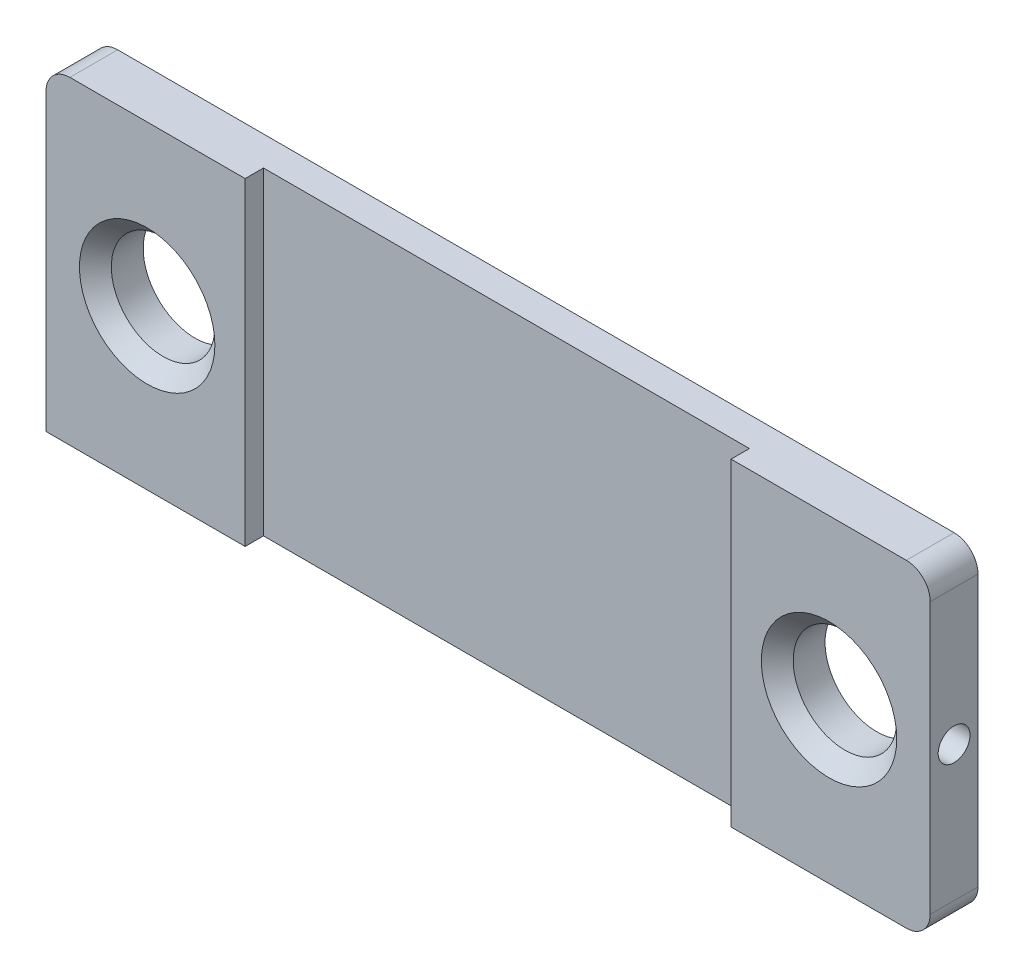
ISO-10303-21;
HEADER;
FILE_DESCRIPTION(('STEP AP214'),'2;1');
FILE_NAME('part.step','',(''),(''),'','','');
FILE_SCHEMA(('AUTOMOTIVE_DESIGN { 1 0 10303 214 1 1 1 1 }'));
ENDSEC;
DATA;
#1=APPLICATION_CONTEXT('core data for automotive mechanical design processes');
#2=APPLICATION_PROTOCOL_DEFINITION('international standard','automotive_design',2000,#1);
#3=PRODUCT_CONTEXT('',#1,'mechanical');
#4=PRODUCT('Part','Part','',(#3));
#5=PRODUCT_RELATED_PRODUCT_CATEGORY('part','',(#4));
#6=PRODUCT_DEFINITION_FORMATION('','',#4);
#7=PRODUCT_DEFINITION_CONTEXT('part definition',#1,'design');
#8=PRODUCT_DEFINITION('design','',#6,#7);
#9=PRODUCT_DEFINITION_SHAPE('','',#8);
#10=(LENGTH_UNIT() NAMED_UNIT(*) SI_UNIT(.MILLI.,.METRE.));
#11=(NAMED_UNIT(*) PLANE_ANGLE_UNIT() SI_UNIT($,.RADIAN.));
#12=(NAMED_UNIT(*) SI_UNIT($,.STERADIAN.) SOLID_ANGLE_UNIT());
#13=UNCERTAINTY_MEASURE_WITH_UNIT(LENGTH_MEASURE(1.E-05),#10,'distance_accuracy_value','');
#14=(GEOMETRIC_REPRESENTATION_CONTEXT(3) GLOBAL_UNCERTAINTY_ASSIGNED_CONTEXT((#13)) GLOBAL_UNIT_ASSIGNED_CONTEXT((#10,
#11,#12)) REPRESENTATION_CONTEXT('',''));
#15=CARTESIAN_POINT('',(0.,0.,0.));
#16=DIRECTION('',(0.,0.,1.));
#17=DIRECTION('',(1.,0.,0.));
#18=AXIS2_PLACEMENT_3D('',#15,#16,#17);
#19=CARTESIAN_POINT('',(0.,-91.9139935115387,3.));
#20=DIRECTION('',(0.,0.,1.));
#21=DIRECTION('',(1.,0.,0.));
#22=AXIS2_PLACEMENT_3D('',#19,#20,#21);
#23=PLANE('',#22);
#24=DIRECTION('',(0.,-1.,0.));
#25=VECTOR('',#24,1.);
#26=CARTESIAN_POINT('',(-30.5,20.,3.));
#27=LINE('',#26,#25);
#28=CARTESIAN_POINT('',(-30.5,20.,3.));
#29=VERTEX_POINT('',#28);
#30=CARTESIAN_POINT('',(-30.5,-20.,3.));
#31=VERTEX_POINT('',#30);
#32=EDGE_CURVE('E145',#29,#31,#27,.T.);
#33=ORIENTED_EDGE('',*,*,#32,.F.);
#34=DIRECTION('',(1.,0.,0.));
#35=VECTOR('',#34,1.);
#36=CARTESIAN_POINT('',(0.,20.,3.));
#37=LINE('',#36,#35);
#38=CARTESIAN_POINT('',(-52.5,20.,3.));
#39=VERTEX_POINT('',#38);
#40=EDGE_CURVE('E191',#39,#29,#37,.T.);
#41=ORIENTED_EDGE('',*,*,#40,.F.);
#42=CARTESIAN_POINT('',(-52.5,17.,3.));
#43=DIRECTION('',(0.,0.,1.));
#44=DIRECTION('',(1.,0.,0.));
#45=AXIS2_PLACEMENT_3D('',#42,#43,#44);
#46=CIRCLE('',#45,3.);
#47=CARTESIAN_POINT('',(-55.5,17.,3.));
#48=VERTEX_POINT('',#47);
#49=EDGE_CURVE('E51',#39,#48,#46,.T.);
#50=ORIENTED_EDGE('',*,*,#49,.T.);
#51=DIRECTION('',(0.,-1.,0.));
#52=VECTOR('',#51,1.);
#53=CARTESIAN_POINT('',(-55.5,-91.9139935115387,3.));
#54=LINE('',#53,#52);
#55=CARTESIAN_POINT('',(-55.5,-20.,3.));
#56=VERTEX_POINT('',#55);
#57=EDGE_CURVE('E194',#48,#56,#54,.T.);
#58=ORIENTED_EDGE('',*,*,#57,.T.);
#59=DIRECTION('',(1.,0.,0.));
#60=VECTOR('',#59,1.);
#61=CARTESIAN_POINT('',(0.,-20.,3.));
#62=LINE('',#61,#60);
#63=EDGE_CURVE('E197',#56,#31,#62,.T.);
#64=ORIENTED_EDGE('',*,*,#63,.T.);
#65=EDGE_LOOP('',(#33,#41,#50,#58,#64));
#66=FACE_BOUND('',#65,.T.);
#67=CARTESIAN_POINT('',(-42.8,0.,3.));
#68=DIRECTION('',(0.,0.,1.));
#69=DIRECTION('',(1.,0.,0.));
#70=AXIS2_PLACEMENT_3D('',#67,#68,#69);
#71=CIRCLE('',#70,8.50000000000001);
#72=CARTESIAN_POINT('',(-34.3,0.,3.));
#73=VERTEX_POINT('',#72);
#74=EDGE_CURVE('E234',#73,#73,#71,.F.);
#75=ORIENTED_EDGE('',*,*,#74,.T.);
#76=EDGE_LOOP('',(#75));
#77=FACE_BOUND('',#76,.T.);
#78=ADVANCED_FACE('F28',(#66,#77),#23,.T.);
#79=CARTESIAN_POINT('',(55.5,-91.9139935115387,3.));
#80=DIRECTION('',(1.,0.,0.));
#81=DIRECTION('',(0.,1.,0.));
#82=AXIS2_PLACEMENT_3D('',#79,#80,#81);
#83=PLANE('',#82);
#84=CARTESIAN_POINT('',(55.5,0.,0.));
#85=DIRECTION('',(1.,0.,0.));
#86=DIRECTION('',(0.,0.,-1.));
#87=AXIS2_PLACEMENT_3D('',#84,#85,#86);
#88=CIRCLE('',#87,2.);
#89=CARTESIAN_POINT('',(55.5,0.,-2.));
#90=VERTEX_POINT('',#89);
#91=EDGE_CURVE('E136',#90,#90,#88,.T.);
#92=ORIENTED_EDGE('',*,*,#91,.F.);
#93=EDGE_LOOP('',(#92));
#94=FACE_BOUND('',#93,.T.);
#95=DIRECTION('',(0.,-1.,0.));
#96=VECTOR('',#95,1.);
#97=CARTESIAN_POINT('',(55.5,-91.9139935115387,3.));
#98=LINE('',#97,#96);
#99=CARTESIAN_POINT('',(55.5,17.,3.));
#100=VERTEX_POINT('',#99);
#101=CARTESIAN_POINT('',(55.5,-17.,3.));
#102=VERTEX_POINT('',#101);
#103=EDGE_CURVE('E187',#100,#102,#98,.T.);
#104=ORIENTED_EDGE('',*,*,#103,.T.);
#105=DIRECTION('',(0.,0.,-1.));
#106=VECTOR('',#105,1.);
#107=CARTESIAN_POINT('',(55.5,-17.,-3.));
#108=LINE('',#107,#106);
#109=CARTESIAN_POINT('',(55.5,-17.,-3.));
#110=VERTEX_POINT('',#109);
#111=EDGE_CURVE('E205',#102,#110,#108,.T.);
#112=ORIENTED_EDGE('',*,*,#111,.T.);
#113=DIRECTION('',(0.,-1.,0.));
#114=VECTOR('',#113,1.);
#115=CARTESIAN_POINT('',(55.5,-91.9139935115387,-3.));
#116=LINE('',#115,#114);
#117=CARTESIAN_POINT('',(55.5,17.,-3.));
#118=VERTEX_POINT('',#117);
#119=EDGE_CURVE('E176',#118,#110,#116,.T.);
#120=ORIENTED_EDGE('',*,*,#119,.F.);
#121=DIRECTION('',(0.,0.,-1.));
#122=VECTOR('',#121,1.);
#123=CARTESIAN_POINT('',(55.5,17.,3.));
#124=LINE('',#123,#122);
#125=EDGE_CURVE('E203',#118,#100,#124,.F.);
#126=ORIENTED_EDGE('',*,*,#125,.T.);
#127=EDGE_LOOP('',(#104,#112,#120,#126));
#128=FACE_BOUND('',#127,.T.);
#129=ADVANCED_FACE('F266',(#94,#128),#83,.T.);
#130=CARTESIAN_POINT('',(0.,20.,3.));
#131=DIRECTION('',(0.,1.,0.));
#132=DIRECTION('',(0.,0.,1.));
#133=AXIS2_PLACEMENT_3D('',#130,#131,#132);
#134=PLANE('',#133);
#135=DIRECTION('',(0.,0.,1.));
#136=VECTOR('',#135,1.);
#137=CARTESIAN_POINT('',(-30.5,20.,0.7));
#138=LINE('',#137,#136);
#139=CARTESIAN_POINT('',(-30.5,20.,0.7));
#140=VERTEX_POINT('',#139);
#141=EDGE_CURVE('E162',#140,#29,#138,.T.);
#142=ORIENTED_EDGE('',*,*,#141,.F.);
#143=DIRECTION('',(-1.,0.,0.));
#144=VECTOR('',#143,1.);
#145=CARTESIAN_POINT('',(-30.5,20.,0.7));
#146=LINE('',#145,#144);
#147=CARTESIAN_POINT('',(30.5,20.,0.7));
#148=VERTEX_POINT('',#147);
#149=EDGE_CURVE('E158',#148,#140,#146,.T.);
#150=ORIENTED_EDGE('',*,*,#149,.F.);
#151=DIRECTION('',(0.,0.,1.));
#152=VECTOR('',#151,1.);
#153=CARTESIAN_POINT('',(30.5,20.,0.7));
#154=LINE('',#153,#152);
#155=CARTESIAN_POINT('',(30.5,20.,3.));
#156=VERTEX_POINT('',#155);
#157=EDGE_CURVE('E165',#148,#156,#154,.T.);
#158=ORIENTED_EDGE('',*,*,#157,.T.);
#159=CARTESIAN_POINT('',(52.5,20.,3.));
#160=VERTEX_POINT('',#159);
#161=EDGE_CURVE('E190',#156,#160,#37,.T.);
#162=ORIENTED_EDGE('',*,*,#161,.T.);
#163=DIRECTION('',(0.,0.,-1.));
#164=VECTOR('',#163,1.);
#165=CARTESIAN_POINT('',(52.5,20.,3.));
#166=LINE('',#165,#164);
#167=CARTESIAN_POINT('',(52.5,20.,-3.));
#168=VERTEX_POINT('',#167);
#169=EDGE_CURVE('E225',#160,#168,#166,.T.);
#170=ORIENTED_EDGE('',*,*,#169,.T.);
#171=DIRECTION('',(1.,0.,0.));
#172=VECTOR('',#171,1.);
#173=CARTESIAN_POINT('',(0.,20.,-3.));
#174=LINE('',#173,#172);
#175=CARTESIAN_POINT('',(-52.5,20.,-3.));
#176=VERTEX_POINT('',#175);
#177=EDGE_CURVE('E179',#176,#168,#174,.T.);
#178=ORIENTED_EDGE('',*,*,#177,.F.);
#179=DIRECTION('',(0.,0.,-1.));
#180=VECTOR('',#179,1.);
#181=CARTESIAN_POINT('',(-52.5,20.,3.));
#182=LINE('',#181,#180);
#183=EDGE_CURVE('E223',#176,#39,#182,.F.);
#184=ORIENTED_EDGE('',*,*,#183,.T.);
#185=ORIENTED_EDGE('',*,*,#40,.T.);
#186=EDGE_LOOP('',(#142,#150,#158,#162,#170,#178,#184,#185));
#187=FACE_BOUND('',#186,.T.);
#188=ADVANCED_FACE('F292',(#187),#134,.T.);
#189=CARTESIAN_POINT('',(-55.5,-91.9139935115387,3.));
#190=DIRECTION('',(1.,0.,0.));
#191=DIRECTION('',(0.,1.,0.));
#192=AXIS2_PLACEMENT_3D('',#189,#190,#191);
#193=PLANE('',#192);
#194=CARTESIAN_POINT('',(-55.5,-17.9,0.));
#195=DIRECTION('',(-1.,0.,0.));
#196=DIRECTION('',(0.,0.,1.));
#197=AXIS2_PLACEMENT_3D('',#194,#195,#196);
#198=CIRCLE('',#197,1.25);
#199=CARTESIAN_POINT('',(-55.5,-17.9,1.25));
#200=VERTEX_POINT('',#199);
#201=EDGE_CURVE('E128',#200,#200,#198,.T.);
#202=ORIENTED_EDGE('',*,*,#201,.F.);
#203=EDGE_LOOP('',(#202));
#204=FACE_BOUND('',#203,.T.);
#205=CARTESIAN_POINT('',(-55.5,0.,0.));
#206=DIRECTION('',(-1.,0.,0.));
#207=DIRECTION('',(0.,0.,1.));
#208=AXIS2_PLACEMENT_3D('',#205,#206,#207);
#209=CIRCLE('',#208,2.);
#210=CARTESIAN_POINT('',(-55.5,0.,2.));
#211=VERTEX_POINT('',#210);
#212=EDGE_CURVE('E142',#211,#211,#209,.T.);
#213=ORIENTED_EDGE('',*,*,#212,.F.);
#214=EDGE_LOOP('',(#213));
#215=FACE_BOUND('',#214,.T.);
#216=ORIENTED_EDGE('',*,*,#57,.F.);
#217=DIRECTION('',(0.,0.,-1.));
#218=VECTOR('',#217,1.);
#219=CARTESIAN_POINT('',(-55.5,17.,-3.));
#220=LINE('',#219,#218);
#221=CARTESIAN_POINT('',(-55.5,17.,-3.));
#222=VERTEX_POINT('',#221);
#223=EDGE_CURVE('E228',#48,#222,#220,.T.);
#224=ORIENTED_EDGE('',*,*,#223,.T.);
#225=DIRECTION('',(0.,-1.,0.));
#226=VECTOR('',#225,1.);
#227=CARTESIAN_POINT('',(-55.5,-91.9139935115387,-3.));
#228=LINE('',#227,#226);
#229=CARTESIAN_POINT('',(-55.5,-20.,-3.));
#230=VERTEX_POINT('',#229);
#231=EDGE_CURVE('E182',#222,#230,#228,.T.);
#232=ORIENTED_EDGE('',*,*,#231,.T.);
#233=DIRECTION('',(0.,0.,-1.));
#234=VECTOR('',#233,1.);
#235=CARTESIAN_POINT('',(-55.5,-20.,3.));
#236=LINE('',#235,#234);
#237=EDGE_CURVE('E200',#56,#230,#236,.T.);
#238=ORIENTED_EDGE('',*,*,#237,.F.);
#239=EDGE_LOOP('',(#216,#224,#232,#238));
#240=FACE_BOUND('',#239,.T.);
#241=ADVANCED_FACE('F286',(#204,#215,#240),#193,.F.);
#242=CARTESIAN_POINT('',(-42.8,0.,3.));
#243=DIRECTION('',(0.,0.,-1.));
#244=DIRECTION('',(-1.,0.,0.));
#245=AXIS2_PLACEMENT_3D('',#242,#243,#244);
#246=CYLINDRICAL_SURFACE('',#245,6.5);
#247=CARTESIAN_POINT('',(-42.8,0.,1.));
#248=DIRECTION('',(0.,0.,1.));
#249=DIRECTION('',(1.,0.,0.));
#250=AXIS2_PLACEMENT_3D('',#247,#248,#249);
#251=CIRCLE('',#250,6.5);
#252=CARTESIAN_POINT('',(-36.3,0.,1.));
#253=VERTEX_POINT('',#252);
#254=EDGE_CURVE('E11',#253,#253,#251,.T.);
#255=ORIENTED_EDGE('',*,*,#254,.T.);
#256=EDGE_LOOP('',(#255));
#257=FACE_BOUND('',#256,.T.);
#258=CARTESIAN_POINT('',(-42.8,0.,-3.));
#259=DIRECTION('',(0.,0.,1.));
#260=DIRECTION('',(1.,0.,0.));
#261=AXIS2_PLACEMENT_3D('',#258,#259,#260);
#262=CIRCLE('',#261,6.5);
#263=CARTESIAN_POINT('',(-36.3,0.,-3.));
#264=VERTEX_POINT('',#263);
#265=EDGE_CURVE('E173',#264,#264,#262,.T.);
#266=ORIENTED_EDGE('',*,*,#265,.F.);
#267=EDGE_LOOP('',(#266));
#268=FACE_BOUND('',#267,.T.);
#269=ADVANCED_FACE('F252',(#257,#268),#246,.F.);
#270=CARTESIAN_POINT('',(42.8,0.,3.));
#271=DIRECTION('',(0.,0.,-1.));
#272=DIRECTION('',(-1.,0.,0.));
#273=AXIS2_PLACEMENT_3D('',#270,#271,#272);
#274=CYLINDRICAL_SURFACE('',#273,6.5);
#275=CARTESIAN_POINT('',(42.8,0.,1.));
#276=DIRECTION('',(0.,0.,1.));
#277=DIRECTION('',(1.,0.,0.));
#278=AXIS2_PLACEMENT_3D('',#275,#276,#277);
#279=CIRCLE('',#278,6.5);
#280=CARTESIAN_POINT('',(49.3,0.,1.));
#281=VERTEX_POINT('',#280);
#282=EDGE_CURVE('E231',#281,#281,#279,.T.);
#283=ORIENTED_EDGE('',*,*,#282,.T.);
#284=EDGE_LOOP('',(#283));
#285=FACE_BOUND('',#284,.T.);
#286=CARTESIAN_POINT('',(42.8,0.,-3.));
#287=DIRECTION('',(0.,0.,1.));
#288=DIRECTION('',(1.,0.,0.));
#289=AXIS2_PLACEMENT_3D('',#286,#287,#288);
#290=CIRCLE('',#289,6.5);
#291=CARTESIAN_POINT('',(49.3,0.,-3.));
#292=VERTEX_POINT('',#291);
#293=EDGE_CURVE('E164',#292,#292,#290,.T.);
#294=ORIENTED_EDGE('',*,*,#293,.F.);
#295=EDGE_LOOP('',(#294));
#296=FACE_BOUND('',#295,.T.);
#297=ADVANCED_FACE('F30',(#285,#296),#274,.F.);
#298=CARTESIAN_POINT('',(0.,-20.,3.));
#299=DIRECTION('',(0.,1.,0.));
#300=DIRECTION('',(-1.,0.,0.));
#301=AXIS2_PLACEMENT_3D('',#298,#299,#300);
#302=PLANE('',#301);
#303=DIRECTION('',(1.,0.,0.));
#304=VECTOR('',#303,1.);
#305=CARTESIAN_POINT('',(-30.5,-20.,0.7));
#306=LINE('',#305,#304);
#307=CARTESIAN_POINT('',(-30.5,-20.,0.7));
#308=VERTEX_POINT('',#307);
#309=CARTESIAN_POINT('',(30.5,-20.,0.7));
#310=VERTEX_POINT('',#309);
#311=EDGE_CURVE('E152',#308,#310,#306,.T.);
#312=ORIENTED_EDGE('',*,*,#311,.F.);
#313=DIRECTION('',(0.,0.,1.));
#314=VECTOR('',#313,1.);
#315=CARTESIAN_POINT('',(-30.5,-20.,0.7));
#316=LINE('',#315,#314);
#317=EDGE_CURVE('E161',#308,#31,#316,.T.);
#318=ORIENTED_EDGE('',*,*,#317,.T.);
#319=ORIENTED_EDGE('',*,*,#63,.F.);
#320=ORIENTED_EDGE('',*,*,#237,.T.);
#321=DIRECTION('',(1.,0.,0.));
#322=VECTOR('',#321,1.);
#323=CARTESIAN_POINT('',(0.,-20.,-3.));
#324=LINE('',#323,#322);
#325=CARTESIAN_POINT('',(52.5,-20.,-3.));
#326=VERTEX_POINT('',#325);
#327=EDGE_CURVE('E184',#230,#326,#324,.T.);
#328=ORIENTED_EDGE('',*,*,#327,.T.);
#329=DIRECTION('',(0.,0.,-1.));
#330=VECTOR('',#329,1.);
#331=CARTESIAN_POINT('',(52.5,-20.,3.));
#332=LINE('',#331,#330);
#333=CARTESIAN_POINT('',(52.5,-20.,3.));
#334=VERTEX_POINT('',#333);
#335=EDGE_CURVE('E214',#326,#334,#332,.F.);
#336=ORIENTED_EDGE('',*,*,#335,.T.);
#337=CARTESIAN_POINT('',(30.5,-20.,3.));
#338=VERTEX_POINT('',#337);
#339=EDGE_CURVE('E196',#338,#334,#62,.T.);
#340=ORIENTED_EDGE('',*,*,#339,.F.);
#341=DIRECTION('',(0.,0.,1.));
#342=VECTOR('',#341,1.);
#343=CARTESIAN_POINT('',(30.5,-20.,0.7));
#344=LINE('',#343,#342);
#345=EDGE_CURVE('E43',#310,#338,#344,.T.);
#346=ORIENTED_EDGE('',*,*,#345,.F.);
#347=EDGE_LOOP('',(#312,#318,#319,#320,#328,#336,#340,#346));
#348=FACE_BOUND('',#347,.T.);
#349=ADVANCED_FACE('F251',(#348),#302,.F.);
#350=DIRECTION('',(0.,1.,0.));
#351=VECTOR('',#350,1.);
#352=CARTESIAN_POINT('',(30.5,20.,3.));
#353=LINE('',#352,#351);
#354=EDGE_CURVE('E147',#338,#156,#353,.T.);
#355=ORIENTED_EDGE('',*,*,#354,.F.);
#356=ORIENTED_EDGE('',*,*,#339,.T.);
#357=CARTESIAN_POINT('',(52.5,-17.,3.));
#358=DIRECTION('',(0.,0.,1.));
#359=DIRECTION('',(1.,0.,0.));
#360=AXIS2_PLACEMENT_3D('',#357,#358,#359);
#361=CIRCLE('',#360,3.);
#362=EDGE_CURVE('E221',#334,#102,#361,.T.);
#363=ORIENTED_EDGE('',*,*,#362,.T.);
#364=ORIENTED_EDGE('',*,*,#103,.F.);
#365=CARTESIAN_POINT('',(52.5,17.,3.));
#366=DIRECTION('',(0.,0.,1.));
#367=DIRECTION('',(1.,0.,0.));
#368=AXIS2_PLACEMENT_3D('',#365,#366,#367);
#369=CIRCLE('',#368,3.);
#370=EDGE_CURVE('E218',#100,#160,#369,.T.);
#371=ORIENTED_EDGE('',*,*,#370,.T.);
#372=ORIENTED_EDGE('',*,*,#161,.F.);
#373=EDGE_LOOP('',(#355,#356,#363,#364,#371,#372));
#374=FACE_BOUND('',#373,.T.);
#375=CARTESIAN_POINT('',(42.8,0.,3.));
#376=DIRECTION('',(0.,0.,1.));
#377=DIRECTION('',(1.,0.,0.));
#378=AXIS2_PLACEMENT_3D('',#375,#376,#377);
#379=CIRCLE('',#378,8.50000000000001);
#380=CARTESIAN_POINT('',(51.3,0.,3.));
#381=VERTEX_POINT('',#380);
#382=EDGE_CURVE('E36',#381,#381,#379,.F.);
#383=ORIENTED_EDGE('',*,*,#382,.T.);
#384=EDGE_LOOP('',(#383));
#385=FACE_BOUND('',#384,.T.);
#386=ADVANCED_FACE('F239',(#374,#385),#23,.T.);
#387=CARTESIAN_POINT('',(0.,-91.9139935115387,-3.));
#388=DIRECTION('',(0.,0.,1.));
#389=DIRECTION('',(1.,0.,0.));
#390=AXIS2_PLACEMENT_3D('',#387,#388,#389);
#391=PLANE('',#390);
#392=ORIENTED_EDGE('',*,*,#293,.T.);
#393=EDGE_LOOP('',(#392));
#394=FACE_BOUND('',#393,.T.);
#395=ORIENTED_EDGE('',*,*,#265,.T.);
#396=EDGE_LOOP('',(#395));
#397=FACE_BOUND('',#396,.T.);
#398=ORIENTED_EDGE('',*,*,#119,.T.);
#399=CARTESIAN_POINT('',(52.5,-17.,-3.));
#400=DIRECTION('',(0.,0.,1.));
#401=DIRECTION('',(1.,0.,0.));
#402=AXIS2_PLACEMENT_3D('',#399,#400,#401);
#403=CIRCLE('',#402,3.);
#404=EDGE_CURVE('E212',#110,#326,#403,.F.);
#405=ORIENTED_EDGE('',*,*,#404,.T.);
#406=ORIENTED_EDGE('',*,*,#327,.F.);
#407=ORIENTED_EDGE('',*,*,#231,.F.);
#408=CARTESIAN_POINT('',(-52.5,17.,-3.));
#409=DIRECTION('',(0.,0.,1.));
#410=DIRECTION('',(1.,0.,0.));
#411=AXIS2_PLACEMENT_3D('',#408,#409,#410);
#412=CIRCLE('',#411,3.);
#413=EDGE_CURVE('E208',#222,#176,#412,.F.);
#414=ORIENTED_EDGE('',*,*,#413,.T.);
#415=ORIENTED_EDGE('',*,*,#177,.T.);
#416=CARTESIAN_POINT('',(52.5,17.,-3.));
#417=DIRECTION('',(0.,0.,1.));
#418=DIRECTION('',(1.,0.,0.));
#419=AXIS2_PLACEMENT_3D('',#416,#417,#418);
#420=CIRCLE('',#419,3.);
#421=EDGE_CURVE('E210',#168,#118,#420,.F.);
#422=ORIENTED_EDGE('',*,*,#421,.T.);
#423=EDGE_LOOP('',(#398,#405,#406,#407,#414,#415,#422));
#424=FACE_BOUND('',#423,.T.);
#425=ADVANCED_FACE('F255',(#394,#397,#424),#391,.F.);
#426=CARTESIAN_POINT('',(52.5,-17.,3.));
#427=DIRECTION('',(0.,0.,1.));
#428=DIRECTION('',(1.,0.,0.));
#429=AXIS2_PLACEMENT_3D('',#426,#427,#428);
#430=CYLINDRICAL_SURFACE('',#429,3.);
#431=ORIENTED_EDGE('',*,*,#362,.F.);
#432=ORIENTED_EDGE('',*,*,#335,.F.);
#433=ORIENTED_EDGE('',*,*,#404,.F.);
#434=ORIENTED_EDGE('',*,*,#111,.F.);
#435=EDGE_LOOP('',(#431,#432,#433,#434));
#436=FACE_BOUND('',#435,.T.);
#437=ADVANCED_FACE('F258',(#436),#430,.T.);
#438=CARTESIAN_POINT('',(52.5,17.,3.));
#439=DIRECTION('',(0.,0.,-1.));
#440=DIRECTION('',(-1.,0.,0.));
#441=AXIS2_PLACEMENT_3D('',#438,#439,#440);
#442=CYLINDRICAL_SURFACE('',#441,3.);
#443=ORIENTED_EDGE('',*,*,#370,.F.);
#444=ORIENTED_EDGE('',*,*,#125,.F.);
#445=ORIENTED_EDGE('',*,*,#421,.F.);
#446=ORIENTED_EDGE('',*,*,#169,.F.);
#447=EDGE_LOOP('',(#443,#444,#445,#446));
#448=FACE_BOUND('',#447,.T.);
#449=ADVANCED_FACE('F271',(#448),#442,.T.);
#450=CARTESIAN_POINT('',(-52.5,17.,3.));
#451=DIRECTION('',(0.,0.,1.));
#452=DIRECTION('',(1.,0.,0.));
#453=AXIS2_PLACEMENT_3D('',#450,#451,#452);
#454=CYLINDRICAL_SURFACE('',#453,3.);
#455=ORIENTED_EDGE('',*,*,#49,.F.);
#456=ORIENTED_EDGE('',*,*,#183,.F.);
#457=ORIENTED_EDGE('',*,*,#413,.F.);
#458=ORIENTED_EDGE('',*,*,#223,.F.);
#459=EDGE_LOOP('',(#455,#456,#457,#458));
#460=FACE_BOUND('',#459,.T.);
#461=ADVANCED_FACE('F245',(#460),#454,.T.);
#462=CARTESIAN_POINT('',(42.8,0.,1.));
#463=DIRECTION('',(0.,0.,1.));
#464=DIRECTION('',(1.,0.,0.));
#465=AXIS2_PLACEMENT_3D('',#462,#463,#464);
#466=CONICAL_SURFACE('',#465,6.5,0.78539816339745);
#467=ORIENTED_EDGE('',*,*,#382,.F.);
#468=EDGE_LOOP('',(#467));
#469=FACE_BOUND('',#468,.T.);
#470=ORIENTED_EDGE('',*,*,#282,.F.);
#471=EDGE_LOOP('',(#470));
#472=FACE_BOUND('',#471,.T.);
#473=ADVANCED_FACE('F241',(#469,#472),#466,.F.);
#474=CARTESIAN_POINT('',(-42.8,0.,1.));
#475=DIRECTION('',(0.,0.,1.));
#476=DIRECTION('',(1.,0.,0.));
#477=AXIS2_PLACEMENT_3D('',#474,#475,#476);
#478=CONICAL_SURFACE('',#477,6.5,0.78539816339745);
#479=ORIENTED_EDGE('',*,*,#74,.F.);
#480=EDGE_LOOP('',(#479));
#481=FACE_BOUND('',#480,.T.);
#482=ORIENTED_EDGE('',*,*,#254,.F.);
#483=EDGE_LOOP('',(#482));
#484=FACE_BOUND('',#483,.T.);
#485=ADVANCED_FACE('F244',(#481,#484),#478,.F.);
#486=CARTESIAN_POINT('',(-30.5,20.,0.7));
#487=DIRECTION('',(-1.,0.,0.));
#488=DIRECTION('',(0.,-1.,0.));
#489=AXIS2_PLACEMENT_3D('',#486,#487,#488);
#490=PLANE('',#489);
#491=ORIENTED_EDGE('',*,*,#32,.T.);
#492=ORIENTED_EDGE('',*,*,#317,.F.);
#493=DIRECTION('',(0.,-1.,0.));
#494=VECTOR('',#493,1.);
#495=CARTESIAN_POINT('',(-30.5,20.,0.7));
#496=LINE('',#495,#494);
#497=EDGE_CURVE('E149',#140,#308,#496,.T.);
#498=ORIENTED_EDGE('',*,*,#497,.F.);
#499=ORIENTED_EDGE('',*,*,#141,.T.);
#500=EDGE_LOOP('',(#491,#492,#498,#499));
#501=FACE_BOUND('',#500,.T.);
#502=ADVANCED_FACE('F296',(#501),#490,.F.);
#503=CARTESIAN_POINT('',(30.5,20.,0.7));
#504=DIRECTION('',(1.,0.,0.));
#505=DIRECTION('',(0.,0.,-1.));
#506=AXIS2_PLACEMENT_3D('',#503,#504,#505);
#507=PLANE('',#506);
#508=ORIENTED_EDGE('',*,*,#354,.T.);
#509=ORIENTED_EDGE('',*,*,#157,.F.);
#510=DIRECTION('',(0.,1.,0.));
#511=VECTOR('',#510,1.);
#512=CARTESIAN_POINT('',(30.5,20.,0.7));
#513=LINE('',#512,#511);
#514=EDGE_CURVE('E155',#310,#148,#513,.T.);
#515=ORIENTED_EDGE('',*,*,#514,.F.);
#516=ORIENTED_EDGE('',*,*,#345,.T.);
#517=EDGE_LOOP('',(#508,#509,#515,#516));
#518=FACE_BOUND('',#517,.T.);
#519=ADVANCED_FACE('F300',(#518),#507,.F.);
#520=CARTESIAN_POINT('',(-30.5,-20.,0.7));
#521=DIRECTION('',(0.,0.,1.));
#522=DIRECTION('',(1.,0.,0.));
#523=AXIS2_PLACEMENT_3D('',#520,#521,#522);
#524=PLANE('',#523);
#525=ORIENTED_EDGE('',*,*,#497,.T.);
#526=ORIENTED_EDGE('',*,*,#311,.T.);
#527=ORIENTED_EDGE('',*,*,#514,.T.);
#528=ORIENTED_EDGE('',*,*,#149,.T.);
#529=EDGE_LOOP('',(#525,#526,#527,#528));
#530=FACE_BOUND('',#529,.T.);
#531=ADVANCED_FACE('F298',(#530),#524,.T.);
#532=CARTESIAN_POINT('',(-55.5,0.,0.));
#533=DIRECTION('',(-1.,0.,0.));
#534=DIRECTION('',(0.,0.,1.));
#535=AXIS2_PLACEMENT_3D('',#532,#533,#534);
#536=CYLINDRICAL_SURFACE('',#535,2.);
#537=CARTESIAN_POINT('',(-51.8,0.,0.));
#538=DIRECTION('',(-1.,0.,0.));
#539=DIRECTION('',(0.,0.,1.));
#540=AXIS2_PLACEMENT_3D('',#537,#538,#539);
#541=CIRCLE('',#540,2.);
#542=CARTESIAN_POINT('',(-51.8,0.,2.));
#543=VERTEX_POINT('',#542);
#544=EDGE_CURVE('E139',#543,#543,#541,.T.);
#545=ORIENTED_EDGE('',*,*,#544,.F.);
#546=EDGE_LOOP('',(#545));
#547=FACE_BOUND('',#546,.T.);
#548=ORIENTED_EDGE('',*,*,#212,.T.);
#549=EDGE_LOOP('',(#548));
#550=FACE_BOUND('',#549,.T.);
#551=ADVANCED_FACE('F307',(#547,#550),#536,.F.);
#552=CARTESIAN_POINT('',(-51.8,0.,0.));
#553=DIRECTION('',(-1.,0.,0.));
#554=DIRECTION('',(0.,0.,1.));
#555=AXIS2_PLACEMENT_3D('',#552,#553,#554);
#556=CONICAL_SURFACE('',#555,2.,0.785398163397447);
#557=CARTESIAN_POINT('',(-49.8,0.,0.));
#558=VERTEX_POINT('',#557);
#559=VERTEX_LOOP('',#558);
#560=FACE_BOUND('',#559,.T.);
#561=ORIENTED_EDGE('',*,*,#544,.T.);
#562=EDGE_LOOP('',(#561));
#563=FACE_BOUND('',#562,.T.);
#564=ADVANCED_FACE('F385',(#560,#563),#556,.F.);
#565=CARTESIAN_POINT('',(55.5,0.,0.));
#566=DIRECTION('',(1.,0.,0.));
#567=DIRECTION('',(0.,0.,-1.));
#568=AXIS2_PLACEMENT_3D('',#565,#566,#567);
#569=CYLINDRICAL_SURFACE('',#568,2.);
#570=CARTESIAN_POINT('',(51.8,0.,0.));
#571=DIRECTION('',(1.,0.,0.));
#572=DIRECTION('',(0.,0.,-1.));
#573=AXIS2_PLACEMENT_3D('',#570,#571,#572);
#574=CIRCLE('',#573,2.);
#575=CARTESIAN_POINT('',(51.8,0.,-2.));
#576=VERTEX_POINT('',#575);
#577=EDGE_CURVE('E131',#576,#576,#574,.T.);
#578=ORIENTED_EDGE('',*,*,#577,.F.);
#579=EDGE_LOOP('',(#578));
#580=FACE_BOUND('',#579,.T.);
#581=ORIENTED_EDGE('',*,*,#91,.T.);
#582=EDGE_LOOP('',(#581));
#583=FACE_BOUND('',#582,.T.);
#584=ADVANCED_FACE('F393',(#580,#583),#569,.F.);
#585=CARTESIAN_POINT('',(51.8,0.,0.));
#586=DIRECTION('',(1.,0.,0.));
#587=DIRECTION('',(0.,0.,-1.));
#588=AXIS2_PLACEMENT_3D('',#585,#586,#587);
#589=CONICAL_SURFACE('',#588,2.,0.785398163397447);
#590=CARTESIAN_POINT('',(49.8,0.,0.));
#591=VERTEX_POINT('',#590);
#592=VERTEX_LOOP('',#591);
#593=FACE_BOUND('',#592,.T.);
#594=ORIENTED_EDGE('',*,*,#577,.T.);
#595=EDGE_LOOP('',(#594));
#596=FACE_BOUND('',#595,.T.);
#597=ADVANCED_FACE('F401',(#593,#596),#589,.F.);
#598=CARTESIAN_POINT('',(-55.5,-17.9,0.));
#599=DIRECTION('',(-1.,0.,0.));
#600=DIRECTION('',(0.,0.,1.));
#601=AXIS2_PLACEMENT_3D('',#598,#599,#600);
#602=CYLINDRICAL_SURFACE('',#601,1.25);
#603=CARTESIAN_POINT('',(-48.,-17.9,0.));
#604=DIRECTION('',(-1.,0.,0.));
#605=DIRECTION('',(0.,0.,1.));
#606=AXIS2_PLACEMENT_3D('',#603,#604,#605);
#607=CIRCLE('',#606,1.25);
#608=CARTESIAN_POINT('',(-48.,-17.9,1.25));
#609=VERTEX_POINT('',#608);
#610=EDGE_CURVE('E126',#609,#609,#607,.T.);
#611=ORIENTED_EDGE('',*,*,#610,.F.);
#612=EDGE_LOOP('',(#611));
#613=FACE_BOUND('',#612,.T.);
#614=ORIENTED_EDGE('',*,*,#201,.T.);
#615=EDGE_LOOP('',(#614));
#616=FACE_BOUND('',#615,.T.);
#617=ADVANCED_FACE('F122',(#613,#616),#602,.F.);
#618=CARTESIAN_POINT('',(-48.,-17.9,0.));
#619=DIRECTION('',(-1.,0.,0.));
#620=DIRECTION('',(0.,0.,1.));
#621=AXIS2_PLACEMENT_3D('',#618,#619,#620);
#622=CONICAL_SURFACE('',#621,1.25,1.02974425867665);
#623=CARTESIAN_POINT('',(-47.2489242262155,-17.9,0.));
#624=VERTEX_POINT('',#623);
#625=VERTEX_LOOP('',#624);
#626=FACE_BOUND('',#625,.T.);
#627=ORIENTED_EDGE('',*,*,#610,.T.);
#628=EDGE_LOOP('',(#627));
#629=FACE_BOUND('',#628,.T.);
#630=ADVANCED_FACE('F119',(#626,#629),#622,.F.);
#631=CLOSED_SHELL('',(#78,#129,#188,#241,#269,#297,#349,#386,#425,#437,#449,#461,#473,#485,#502,
#519,#531,#551,#564,#584,#597,#617,#630));
#632=MANIFOLD_SOLID_BREP('B2',#631);
#633=ADVANCED_BREP_SHAPE_REPRESENTATION('',(#18,#632),#14);
#634=SHAPE_DEFINITION_REPRESENTATION(#9,#633);
ENDSEC;
END-ISO-10303-21;
